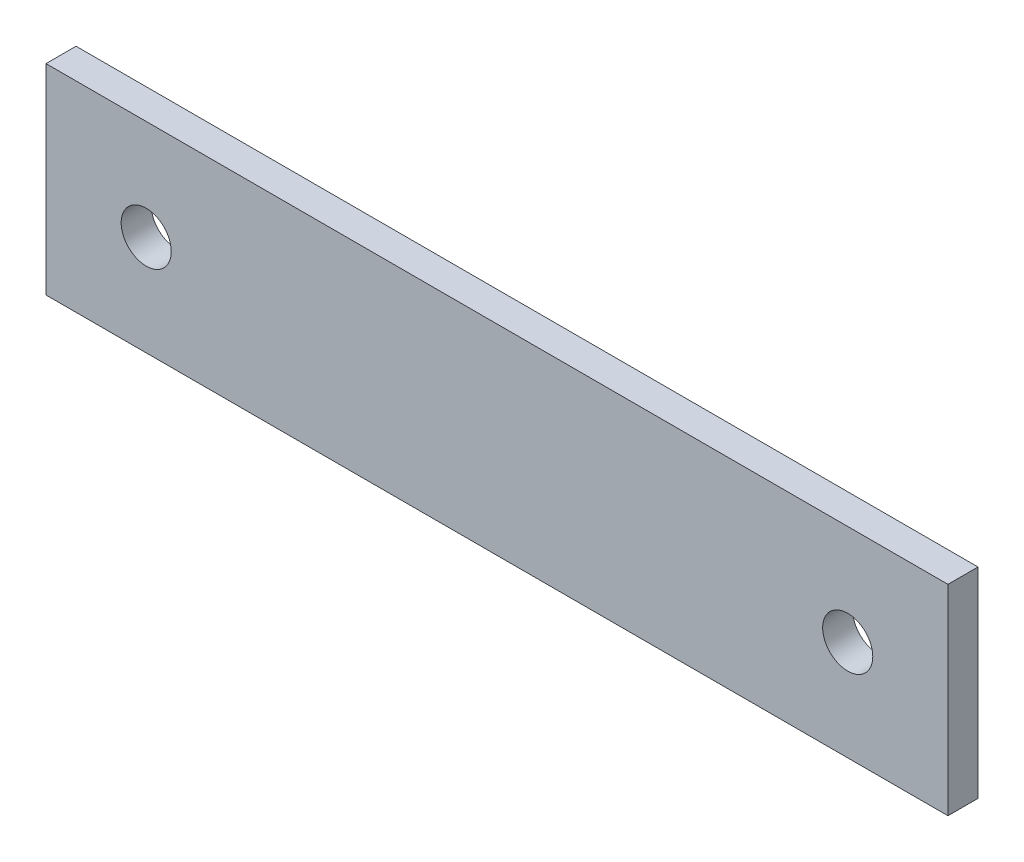
ISO-10303-21;
HEADER;
FILE_DESCRIPTION(('STEP AP214'),'2;1');
FILE_NAME('part.step','',(''),(''),'','','');
FILE_SCHEMA(('AUTOMOTIVE_DESIGN { 1 0 10303 214 1 1 1 1 }'));
ENDSEC;
DATA;
#1=APPLICATION_CONTEXT('core data for automotive mechanical design processes');
#2=APPLICATION_PROTOCOL_DEFINITION('international standard','automotive_design',2000,#1);
#3=PRODUCT_CONTEXT('',#1,'mechanical');
#4=PRODUCT('Part','Part','',(#3));
#5=PRODUCT_RELATED_PRODUCT_CATEGORY('part','',(#4));
#6=PRODUCT_DEFINITION_FORMATION('','',#4);
#7=PRODUCT_DEFINITION_CONTEXT('part definition',#1,'design');
#8=PRODUCT_DEFINITION('design','',#6,#7);
#9=PRODUCT_DEFINITION_SHAPE('','',#8);
#10=(LENGTH_UNIT() NAMED_UNIT(*) SI_UNIT(.MILLI.,.METRE.));
#11=(NAMED_UNIT(*) PLANE_ANGLE_UNIT() SI_UNIT($,.RADIAN.));
#12=(NAMED_UNIT(*) SI_UNIT($,.STERADIAN.) SOLID_ANGLE_UNIT());
#13=UNCERTAINTY_MEASURE_WITH_UNIT(LENGTH_MEASURE(1.E-05),#10,'distance_accuracy_value','');
#14=(GEOMETRIC_REPRESENTATION_CONTEXT(3) GLOBAL_UNCERTAINTY_ASSIGNED_CONTEXT((#13)) GLOBAL_UNIT_ASSIGNED_CONTEXT((#10,
#11,#12)) REPRESENTATION_CONTEXT('',''));
#15=CARTESIAN_POINT('',(0.,0.,0.));
#16=DIRECTION('',(0.,0.,1.));
#17=DIRECTION('',(1.,0.,0.));
#18=AXIS2_PLACEMENT_3D('',#15,#16,#17);
#19=CARTESIAN_POINT('',(0.,0.,3.));
#20=DIRECTION('',(0.,0.,-1.));
#21=DIRECTION('',(-1.,0.,0.));
#22=AXIS2_PLACEMENT_3D('',#19,#20,#21);
#23=PLANE('',#22);
#24=DIRECTION('',(0.,-1.,0.));
#25=VECTOR('',#24,1.);
#26=CARTESIAN_POINT('',(0.,0.,3.));
#27=LINE('',#26,#25);
#28=CARTESIAN_POINT('',(0.,20.,3.));
#29=VERTEX_POINT('',#28);
#30=CARTESIAN_POINT('',(0.,0.,3.));
#31=VERTEX_POINT('',#30);
#32=EDGE_CURVE('E85',#29,#31,#27,.T.);
#33=ORIENTED_EDGE('',*,*,#32,.T.);
#34=DIRECTION('',(1.,0.,0.));
#35=VECTOR('',#34,1.);
#36=CARTESIAN_POINT('',(0.,0.,3.));
#37=LINE('',#36,#35);
#38=CARTESIAN_POINT('',(90.,0.,3.));
#39=VERTEX_POINT('',#38);
#40=EDGE_CURVE('E80',#31,#39,#37,.T.);
#41=ORIENTED_EDGE('',*,*,#40,.T.);
#42=DIRECTION('',(0.,1.,0.));
#43=VECTOR('',#42,1.);
#44=CARTESIAN_POINT('',(90.,0.,3.));
#45=LINE('',#44,#43);
#46=CARTESIAN_POINT('',(90.,20.,3.));
#47=VERTEX_POINT('',#46);
#48=EDGE_CURVE('E83',#39,#47,#45,.T.);
#49=ORIENTED_EDGE('',*,*,#48,.T.);
#50=DIRECTION('',(-1.,0.,0.));
#51=VECTOR('',#50,1.);
#52=CARTESIAN_POINT('',(0.,20.,3.));
#53=LINE('',#52,#51);
#54=EDGE_CURVE('E50',#47,#29,#53,.T.);
#55=ORIENTED_EDGE('',*,*,#54,.T.);
#56=EDGE_LOOP('',(#33,#41,#49,#55));
#57=FACE_BOUND('',#56,.T.);
#58=CARTESIAN_POINT('',(10.,10.,3.));
#59=DIRECTION('',(0.,0.,1.));
#60=DIRECTION('',(1.,0.,0.));
#61=AXIS2_PLACEMENT_3D('',#58,#59,#60);
#62=CIRCLE('',#61,2.5);
#63=CARTESIAN_POINT('',(12.5,10.,3.));
#64=VERTEX_POINT('',#63);
#65=EDGE_CURVE('E100',#64,#64,#62,.T.);
#66=ORIENTED_EDGE('',*,*,#65,.F.);
#67=EDGE_LOOP('',(#66));
#68=FACE_BOUND('',#67,.T.);
#69=CARTESIAN_POINT('',(80.,10.,3.));
#70=DIRECTION('',(0.,0.,1.));
#71=DIRECTION('',(1.,0.,0.));
#72=AXIS2_PLACEMENT_3D('',#69,#70,#71);
#73=CIRCLE('',#72,2.49999999999999);
#74=CARTESIAN_POINT('',(82.5,10.,3.));
#75=VERTEX_POINT('',#74);
#76=EDGE_CURVE('E115',#75,#75,#73,.T.);
#77=ORIENTED_EDGE('',*,*,#76,.F.);
#78=EDGE_LOOP('',(#77));
#79=FACE_BOUND('',#78,.T.);
#80=ADVANCED_FACE('F33',(#57,#68,#79),#23,.F.);
#81=CARTESIAN_POINT('',(0.,0.,0.));
#82=DIRECTION('',(0.,0.,-1.));
#83=DIRECTION('',(-1.,0.,0.));
#84=AXIS2_PLACEMENT_3D('',#81,#82,#83);
#85=PLANE('',#84);
#86=CARTESIAN_POINT('',(10.,10.,0.));
#87=DIRECTION('',(0.,0.,1.));
#88=DIRECTION('',(1.,0.,0.));
#89=AXIS2_PLACEMENT_3D('',#86,#87,#88);
#90=CIRCLE('',#89,2.5);
#91=CARTESIAN_POINT('',(12.5,10.,0.));
#92=VERTEX_POINT('',#91);
#93=EDGE_CURVE('E112',#92,#92,#90,.T.);
#94=ORIENTED_EDGE('',*,*,#93,.T.);
#95=EDGE_LOOP('',(#94));
#96=FACE_BOUND('',#95,.T.);
#97=DIRECTION('',(0.,-1.,0.));
#98=VECTOR('',#97,1.);
#99=CARTESIAN_POINT('',(0.,0.,0.));
#100=LINE('',#99,#98);
#101=CARTESIAN_POINT('',(0.,20.,0.));
#102=VERTEX_POINT('',#101);
#103=CARTESIAN_POINT('',(0.,0.,0.));
#104=VERTEX_POINT('',#103);
#105=EDGE_CURVE('E97',#102,#104,#100,.T.);
#106=ORIENTED_EDGE('',*,*,#105,.F.);
#107=DIRECTION('',(-1.,0.,0.));
#108=VECTOR('',#107,1.);
#109=CARTESIAN_POINT('',(0.,20.,0.));
#110=LINE('',#109,#108);
#111=CARTESIAN_POINT('',(90.,20.,0.));
#112=VERTEX_POINT('',#111);
#113=EDGE_CURVE('E73',#112,#102,#110,.T.);
#114=ORIENTED_EDGE('',*,*,#113,.F.);
#115=DIRECTION('',(0.,1.,0.));
#116=VECTOR('',#115,1.);
#117=CARTESIAN_POINT('',(90.,0.,0.));
#118=LINE('',#117,#116);
#119=CARTESIAN_POINT('',(90.,0.,0.));
#120=VERTEX_POINT('',#119);
#121=EDGE_CURVE('E67',#120,#112,#118,.T.);
#122=ORIENTED_EDGE('',*,*,#121,.F.);
#123=DIRECTION('',(1.,0.,0.));
#124=VECTOR('',#123,1.);
#125=CARTESIAN_POINT('',(0.,0.,0.));
#126=LINE('',#125,#124);
#127=EDGE_CURVE('E89',#104,#120,#126,.T.);
#128=ORIENTED_EDGE('',*,*,#127,.F.);
#129=EDGE_LOOP('',(#106,#114,#122,#128));
#130=FACE_BOUND('',#129,.T.);
#131=CARTESIAN_POINT('',(80.,10.,0.));
#132=DIRECTION('',(0.,0.,1.));
#133=DIRECTION('',(1.,0.,0.));
#134=AXIS2_PLACEMENT_3D('',#131,#132,#133);
#135=CIRCLE('',#134,2.49999999999999);
#136=CARTESIAN_POINT('',(82.5,10.,0.));
#137=VERTEX_POINT('',#136);
#138=EDGE_CURVE('E118',#137,#137,#135,.T.);
#139=ORIENTED_EDGE('',*,*,#138,.T.);
#140=EDGE_LOOP('',(#139));
#141=FACE_BOUND('',#140,.T.);
#142=ADVANCED_FACE('F108',(#96,#130,#141),#85,.T.);
#143=CARTESIAN_POINT('',(0.,0.,3.));
#144=DIRECTION('',(1.,0.,0.));
#145=DIRECTION('',(0.,0.,-1.));
#146=AXIS2_PLACEMENT_3D('',#143,#144,#145);
#147=PLANE('',#146);
#148=ORIENTED_EDGE('',*,*,#105,.T.);
#149=DIRECTION('',(0.,0.,-1.));
#150=VECTOR('',#149,1.);
#151=CARTESIAN_POINT('',(0.,0.,3.));
#152=LINE('',#151,#150);
#153=EDGE_CURVE('E11',#31,#104,#152,.T.);
#154=ORIENTED_EDGE('',*,*,#153,.F.);
#155=ORIENTED_EDGE('',*,*,#32,.F.);
#156=DIRECTION('',(0.,0.,-1.));
#157=VECTOR('',#156,1.);
#158=CARTESIAN_POINT('',(0.,20.,3.));
#159=LINE('',#158,#157);
#160=EDGE_CURVE('E93',#29,#102,#159,.T.);
#161=ORIENTED_EDGE('',*,*,#160,.T.);
#162=EDGE_LOOP('',(#148,#154,#155,#161));
#163=FACE_BOUND('',#162,.T.);
#164=ADVANCED_FACE('F35',(#163),#147,.F.);
#165=CARTESIAN_POINT('',(0.,0.,3.));
#166=DIRECTION('',(0.,1.,0.));
#167=DIRECTION('',(0.,0.,1.));
#168=AXIS2_PLACEMENT_3D('',#165,#166,#167);
#169=PLANE('',#168);
#170=ORIENTED_EDGE('',*,*,#127,.T.);
#171=DIRECTION('',(0.,0.,-1.));
#172=VECTOR('',#171,1.);
#173=CARTESIAN_POINT('',(90.,0.,3.));
#174=LINE('',#173,#172);
#175=EDGE_CURVE('E42',#39,#120,#174,.T.);
#176=ORIENTED_EDGE('',*,*,#175,.F.);
#177=ORIENTED_EDGE('',*,*,#40,.F.);
#178=ORIENTED_EDGE('',*,*,#153,.T.);
#179=EDGE_LOOP('',(#170,#176,#177,#178));
#180=FACE_BOUND('',#179,.T.);
#181=ADVANCED_FACE('F88',(#180),#169,.F.);
#182=CARTESIAN_POINT('',(90.,0.,3.));
#183=DIRECTION('',(-1.,0.,0.));
#184=DIRECTION('',(0.,0.,1.));
#185=AXIS2_PLACEMENT_3D('',#182,#183,#184);
#186=PLANE('',#185);
#187=ORIENTED_EDGE('',*,*,#121,.T.);
#188=DIRECTION('',(0.,0.,-1.));
#189=VECTOR('',#188,1.);
#190=CARTESIAN_POINT('',(90.,20.,3.));
#191=LINE('',#190,#189);
#192=EDGE_CURVE('E90',#47,#112,#191,.T.);
#193=ORIENTED_EDGE('',*,*,#192,.F.);
#194=ORIENTED_EDGE('',*,*,#48,.F.);
#195=ORIENTED_EDGE('',*,*,#175,.T.);
#196=EDGE_LOOP('',(#187,#193,#194,#195));
#197=FACE_BOUND('',#196,.T.);
#198=ADVANCED_FACE('F91',(#197),#186,.F.);
#199=CARTESIAN_POINT('',(0.,20.,3.));
#200=DIRECTION('',(0.,-1.,0.));
#201=DIRECTION('',(0.,0.,-1.));
#202=AXIS2_PLACEMENT_3D('',#199,#200,#201);
#203=PLANE('',#202);
#204=ORIENTED_EDGE('',*,*,#113,.T.);
#205=ORIENTED_EDGE('',*,*,#160,.F.);
#206=ORIENTED_EDGE('',*,*,#54,.F.);
#207=ORIENTED_EDGE('',*,*,#192,.T.);
#208=EDGE_LOOP('',(#204,#205,#206,#207));
#209=FACE_BOUND('',#208,.T.);
#210=ADVANCED_FACE('F105',(#209),#203,.F.);
#211=CARTESIAN_POINT('',(10.,10.,3.));
#212=DIRECTION('',(0.,0.,-1.));
#213=DIRECTION('',(-1.,0.,0.));
#214=AXIS2_PLACEMENT_3D('',#211,#212,#213);
#215=CYLINDRICAL_SURFACE('',#214,2.5);
#216=ORIENTED_EDGE('',*,*,#65,.T.);
#217=EDGE_LOOP('',(#216));
#218=FACE_BOUND('',#217,.T.);
#219=ORIENTED_EDGE('',*,*,#93,.F.);
#220=EDGE_LOOP('',(#219));
#221=FACE_BOUND('',#220,.T.);
#222=ADVANCED_FACE('F135',(#218,#221),#215,.F.);
#223=CARTESIAN_POINT('',(80.,10.,3.));
#224=DIRECTION('',(0.,0.,-1.));
#225=DIRECTION('',(-1.,0.,0.));
#226=AXIS2_PLACEMENT_3D('',#223,#224,#225);
#227=CYLINDRICAL_SURFACE('',#226,2.49999999999999);
#228=ORIENTED_EDGE('',*,*,#76,.T.);
#229=EDGE_LOOP('',(#228));
#230=FACE_BOUND('',#229,.T.);
#231=ORIENTED_EDGE('',*,*,#138,.F.);
#232=EDGE_LOOP('',(#231));
#233=FACE_BOUND('',#232,.T.);
#234=ADVANCED_FACE('F124',(#230,#233),#227,.F.);
#235=CLOSED_SHELL('',(#80,#142,#164,#181,#198,#210,#222,#234));
#236=MANIFOLD_SOLID_BREP('B2',#235);
#237=ADVANCED_BREP_SHAPE_REPRESENTATION('',(#18,#236),#14);
#238=SHAPE_DEFINITION_REPRESENTATION(#9,#237);
ENDSEC;
END-ISO-10303-21;
